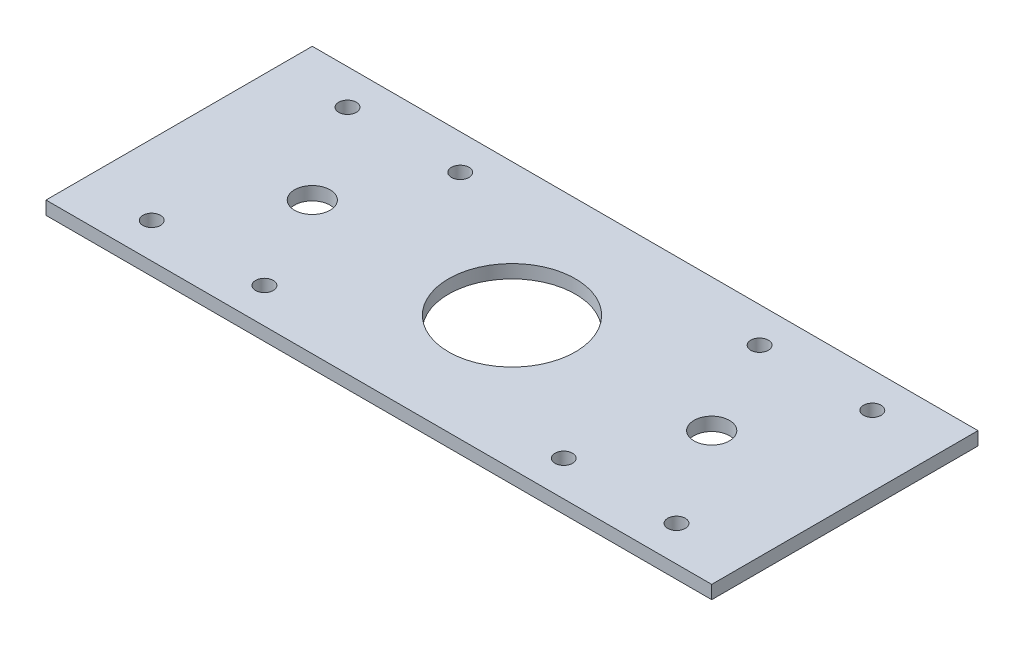
ISO-10303-21;
HEADER;
FILE_DESCRIPTION(('STEP AP214'),'2;1');
FILE_NAME('part.step','',(''),(''),'','','');
FILE_SCHEMA(('AUTOMOTIVE_DESIGN { 1 0 10303 214 1 1 1 1 }'));
ENDSEC;
DATA;
#1=APPLICATION_CONTEXT('core data for automotive mechanical design processes');
#2=APPLICATION_PROTOCOL_DEFINITION('international standard','automotive_design',2000,#1);
#3=PRODUCT_CONTEXT('',#1,'mechanical');
#4=PRODUCT('Part','Part','',(#3));
#5=PRODUCT_RELATED_PRODUCT_CATEGORY('part','',(#4));
#6=PRODUCT_DEFINITION_FORMATION('','',#4);
#7=PRODUCT_DEFINITION_CONTEXT('part definition',#1,'design');
#8=PRODUCT_DEFINITION('design','',#6,#7);
#9=PRODUCT_DEFINITION_SHAPE('','',#8);
#10=(LENGTH_UNIT() NAMED_UNIT(*) SI_UNIT(.MILLI.,.METRE.));
#11=(NAMED_UNIT(*) PLANE_ANGLE_UNIT() SI_UNIT($,.RADIAN.));
#12=(NAMED_UNIT(*) SI_UNIT($,.STERADIAN.) SOLID_ANGLE_UNIT());
#13=UNCERTAINTY_MEASURE_WITH_UNIT(LENGTH_MEASURE(1.E-05),#10,'distance_accuracy_value','');
#14=(GEOMETRIC_REPRESENTATION_CONTEXT(3) GLOBAL_UNCERTAINTY_ASSIGNED_CONTEXT((#13)) GLOBAL_UNIT_ASSIGNED_CONTEXT((#10,
#11,#12)) REPRESENTATION_CONTEXT('',''));
#15=CARTESIAN_POINT('',(0.,0.,0.));
#16=DIRECTION('',(0.,0.,1.));
#17=DIRECTION('',(1.,0.,0.));
#18=AXIS2_PLACEMENT_3D('',#15,#16,#17);
#19=CARTESIAN_POINT('',(0.,3.,30.));
#20=DIRECTION('',(0.,0.,-1.));
#21=DIRECTION('',(-1.,0.,0.));
#22=AXIS2_PLACEMENT_3D('',#19,#20,#21);
#23=PLANE('',#22);
#24=DIRECTION('',(1.,0.,0.));
#25=VECTOR('',#24,1.);
#26=CARTESIAN_POINT('',(0.,0.,30.));
#27=LINE('',#26,#25);
#28=CARTESIAN_POINT('',(-75.,0.,30.));
#29=VERTEX_POINT('',#28);
#30=CARTESIAN_POINT('',(75.,0.,30.));
#31=VERTEX_POINT('',#30);
#32=EDGE_CURVE('E98',#29,#31,#27,.T.);
#33=ORIENTED_EDGE('',*,*,#32,.T.);
#34=DIRECTION('',(0.,-1.,0.));
#35=VECTOR('',#34,1.);
#36=CARTESIAN_POINT('',(75.,3.,30.));
#37=LINE('',#36,#35);
#38=CARTESIAN_POINT('',(75.,3.,30.));
#39=VERTEX_POINT('',#38);
#40=EDGE_CURVE('E11',#39,#31,#37,.T.);
#41=ORIENTED_EDGE('',*,*,#40,.F.);
#42=DIRECTION('',(1.,0.,0.));
#43=VECTOR('',#42,1.);
#44=CARTESIAN_POINT('',(0.,3.,30.));
#45=LINE('',#44,#43);
#46=CARTESIAN_POINT('',(-75.,3.,30.));
#47=VERTEX_POINT('',#46);
#48=EDGE_CURVE('E84',#47,#39,#45,.T.);
#49=ORIENTED_EDGE('',*,*,#48,.F.);
#50=DIRECTION('',(0.,-1.,0.));
#51=VECTOR('',#50,1.);
#52=CARTESIAN_POINT('',(-75.,3.,30.));
#53=LINE('',#52,#51);
#54=EDGE_CURVE('E51',#47,#29,#53,.T.);
#55=ORIENTED_EDGE('',*,*,#54,.T.);
#56=EDGE_LOOP('',(#33,#41,#49,#55));
#57=FACE_BOUND('',#56,.T.);
#58=ADVANCED_FACE('F35',(#57),#23,.F.);
#59=CARTESIAN_POINT('',(75.,3.,0.));
#60=DIRECTION('',(-1.,0.,0.));
#61=DIRECTION('',(0.,0.,1.));
#62=AXIS2_PLACEMENT_3D('',#59,#60,#61);
#63=PLANE('',#62);
#64=DIRECTION('',(0.,0.,-1.));
#65=VECTOR('',#64,1.);
#66=CARTESIAN_POINT('',(75.,0.,0.));
#67=LINE('',#66,#65);
#68=CARTESIAN_POINT('',(75.,0.,-30.));
#69=VERTEX_POINT('',#68);
#70=EDGE_CURVE('E89',#31,#69,#67,.T.);
#71=ORIENTED_EDGE('',*,*,#70,.T.);
#72=DIRECTION('',(0.,-1.,0.));
#73=VECTOR('',#72,1.);
#74=CARTESIAN_POINT('',(75.,3.,-30.));
#75=LINE('',#74,#73);
#76=CARTESIAN_POINT('',(75.,3.,-30.));
#77=VERTEX_POINT('',#76);
#78=EDGE_CURVE('E43',#77,#69,#75,.T.);
#79=ORIENTED_EDGE('',*,*,#78,.F.);
#80=DIRECTION('',(0.,0.,-1.));
#81=VECTOR('',#80,1.);
#82=CARTESIAN_POINT('',(75.,3.,0.));
#83=LINE('',#82,#81);
#84=EDGE_CURVE('E76',#39,#77,#83,.T.);
#85=ORIENTED_EDGE('',*,*,#84,.F.);
#86=ORIENTED_EDGE('',*,*,#40,.T.);
#87=EDGE_LOOP('',(#71,#79,#85,#86));
#88=FACE_BOUND('',#87,.T.);
#89=ADVANCED_FACE('F88',(#88),#63,.F.);
#90=CARTESIAN_POINT('',(0.,3.,-30.));
#91=DIRECTION('',(0.,0.,-1.));
#92=DIRECTION('',(-1.,0.,0.));
#93=AXIS2_PLACEMENT_3D('',#90,#91,#92);
#94=PLANE('',#93);
#95=DIRECTION('',(1.,0.,0.));
#96=VECTOR('',#95,1.);
#97=CARTESIAN_POINT('',(0.,0.,-30.));
#98=LINE('',#97,#96);
#99=CARTESIAN_POINT('',(-75.,0.,-30.));
#100=VERTEX_POINT('',#99);
#101=EDGE_CURVE('E102',#100,#69,#98,.T.);
#102=ORIENTED_EDGE('',*,*,#101,.F.);
#103=DIRECTION('',(0.,-1.,0.));
#104=VECTOR('',#103,1.);
#105=CARTESIAN_POINT('',(-75.,3.,-30.));
#106=LINE('',#105,#104);
#107=CARTESIAN_POINT('',(-75.,3.,-30.));
#108=VERTEX_POINT('',#107);
#109=EDGE_CURVE('E65',#108,#100,#106,.T.);
#110=ORIENTED_EDGE('',*,*,#109,.F.);
#111=DIRECTION('',(1.,0.,0.));
#112=VECTOR('',#111,1.);
#113=CARTESIAN_POINT('',(0.,3.,-30.));
#114=LINE('',#113,#112);
#115=EDGE_CURVE('E83',#108,#77,#114,.T.);
#116=ORIENTED_EDGE('',*,*,#115,.T.);
#117=ORIENTED_EDGE('',*,*,#78,.T.);
#118=EDGE_LOOP('',(#102,#110,#116,#117));
#119=FACE_BOUND('',#118,.T.);
#120=ADVANCED_FACE('F92',(#119),#94,.T.);
#121=CARTESIAN_POINT('',(-75.,3.,0.));
#122=DIRECTION('',(-1.,0.,0.));
#123=DIRECTION('',(0.,0.,1.));
#124=AXIS2_PLACEMENT_3D('',#121,#122,#123);
#125=PLANE('',#124);
#126=DIRECTION('',(0.,0.,-1.));
#127=VECTOR('',#126,1.);
#128=CARTESIAN_POINT('',(-75.,0.,0.));
#129=LINE('',#128,#127);
#130=EDGE_CURVE('E104',#29,#100,#129,.T.);
#131=ORIENTED_EDGE('',*,*,#130,.F.);
#132=ORIENTED_EDGE('',*,*,#54,.F.);
#133=DIRECTION('',(0.,0.,-1.));
#134=VECTOR('',#133,1.);
#135=CARTESIAN_POINT('',(-75.,3.,0.));
#136=LINE('',#135,#134);
#137=EDGE_CURVE('E93',#47,#108,#136,.T.);
#138=ORIENTED_EDGE('',*,*,#137,.T.);
#139=ORIENTED_EDGE('',*,*,#109,.T.);
#140=EDGE_LOOP('',(#131,#132,#138,#139));
#141=FACE_BOUND('',#140,.T.);
#142=ADVANCED_FACE('F188',(#141),#125,.T.);
#143=CARTESIAN_POINT('',(0.,3.,0.));
#144=DIRECTION('',(0.,1.,0.));
#145=DIRECTION('',(0.,0.,1.));
#146=AXIS2_PLACEMENT_3D('',#143,#144,#145);
#147=PLANE('',#146);
#148=CARTESIAN_POINT('',(-45.,3.,0.));
#149=DIRECTION('',(0.,1.,0.));
#150=DIRECTION('',(0.,0.,-1.));
#151=AXIS2_PLACEMENT_3D('',#148,#149,#150);
#152=CIRCLE('',#151,4.00000000000002);
#153=CARTESIAN_POINT('',(-45.,3.,-4.00000000000001));
#154=VERTEX_POINT('',#153);
#155=EDGE_CURVE('E170',#154,#154,#152,.T.);
#156=ORIENTED_EDGE('',*,*,#155,.F.);
#157=EDGE_LOOP('',(#156));
#158=FACE_BOUND('',#157,.T.);
#159=CARTESIAN_POINT('',(45.,3.,0.));
#160=DIRECTION('',(0.,1.,0.));
#161=DIRECTION('',(0.,0.,1.));
#162=AXIS2_PLACEMENT_3D('',#159,#160,#161);
#163=CIRCLE('',#162,4.00000000000001);
#164=CARTESIAN_POINT('',(45.,3.,4.00000000000001));
#165=VERTEX_POINT('',#164);
#166=EDGE_CURVE('E164',#165,#165,#163,.T.);
#167=ORIENTED_EDGE('',*,*,#166,.F.);
#168=EDGE_LOOP('',(#167));
#169=FACE_BOUND('',#168,.T.);
#170=CARTESIAN_POINT('',(-33.725,3.,22.0625));
#171=DIRECTION('',(0.,1.,0.));
#172=DIRECTION('',(0.,0.,1.));
#173=AXIS2_PLACEMENT_3D('',#170,#171,#172);
#174=CIRCLE('',#173,1.98437499999999);
#175=CARTESIAN_POINT('',(-33.725,3.,24.046875));
#176=VERTEX_POINT('',#175);
#177=EDGE_CURVE('E158',#176,#176,#174,.T.);
#178=ORIENTED_EDGE('',*,*,#177,.F.);
#179=EDGE_LOOP('',(#178));
#180=FACE_BOUND('',#179,.T.);
#181=CARTESIAN_POINT('',(-59.125,3.,22.0625));
#182=DIRECTION('',(0.,1.,0.));
#183=DIRECTION('',(0.,0.,1.));
#184=AXIS2_PLACEMENT_3D('',#181,#182,#183);
#185=CIRCLE('',#184,1.98437499999999);
#186=CARTESIAN_POINT('',(-59.125,3.,24.046875));
#187=VERTEX_POINT('',#186);
#188=EDGE_CURVE('E152',#187,#187,#185,.T.);
#189=ORIENTED_EDGE('',*,*,#188,.F.);
#190=EDGE_LOOP('',(#189));
#191=FACE_BOUND('',#190,.T.);
#192=CARTESIAN_POINT('',(-59.125,3.,-22.0625));
#193=DIRECTION('',(0.,1.,0.));
#194=DIRECTION('',(0.,0.,-1.));
#195=AXIS2_PLACEMENT_3D('',#192,#193,#194);
#196=CIRCLE('',#195,1.98437499999999);
#197=CARTESIAN_POINT('',(-59.125,3.,-24.046875));
#198=VERTEX_POINT('',#197);
#199=EDGE_CURVE('E146',#198,#198,#196,.T.);
#200=ORIENTED_EDGE('',*,*,#199,.F.);
#201=EDGE_LOOP('',(#200));
#202=FACE_BOUND('',#201,.T.);
#203=CARTESIAN_POINT('',(-33.725,3.,-22.0625));
#204=DIRECTION('',(0.,1.,0.));
#205=DIRECTION('',(0.,0.,-1.));
#206=AXIS2_PLACEMENT_3D('',#203,#204,#205);
#207=CIRCLE('',#206,1.98437499999999);
#208=CARTESIAN_POINT('',(-33.725,3.,-24.046875));
#209=VERTEX_POINT('',#208);
#210=EDGE_CURVE('E140',#209,#209,#207,.T.);
#211=ORIENTED_EDGE('',*,*,#210,.F.);
#212=EDGE_LOOP('',(#211));
#213=FACE_BOUND('',#212,.T.);
#214=CARTESIAN_POINT('',(59.125,3.,22.0625));
#215=DIRECTION('',(0.,1.,0.));
#216=DIRECTION('',(0.,0.,-1.));
#217=AXIS2_PLACEMENT_3D('',#214,#215,#216);
#218=CIRCLE('',#217,1.98437499999999);
#219=CARTESIAN_POINT('',(59.125,3.,20.078125));
#220=VERTEX_POINT('',#219);
#221=EDGE_CURVE('E134',#220,#220,#218,.T.);
#222=ORIENTED_EDGE('',*,*,#221,.F.);
#223=EDGE_LOOP('',(#222));
#224=FACE_BOUND('',#223,.T.);
#225=CARTESIAN_POINT('',(33.725,3.,22.0625));
#226=DIRECTION('',(0.,1.,0.));
#227=DIRECTION('',(0.,0.,-1.));
#228=AXIS2_PLACEMENT_3D('',#225,#226,#227);
#229=CIRCLE('',#228,1.98437499999999);
#230=CARTESIAN_POINT('',(33.725,3.,20.078125));
#231=VERTEX_POINT('',#230);
#232=EDGE_CURVE('E128',#231,#231,#229,.T.);
#233=ORIENTED_EDGE('',*,*,#232,.F.);
#234=EDGE_LOOP('',(#233));
#235=FACE_BOUND('',#234,.T.);
#236=CARTESIAN_POINT('',(33.725,3.,-22.0625));
#237=DIRECTION('',(0.,1.,0.));
#238=DIRECTION('',(0.,0.,1.));
#239=AXIS2_PLACEMENT_3D('',#236,#237,#238);
#240=CIRCLE('',#239,1.98437499999999);
#241=CARTESIAN_POINT('',(33.725,3.,-20.078125));
#242=VERTEX_POINT('',#241);
#243=EDGE_CURVE('E122',#242,#242,#240,.T.);
#244=ORIENTED_EDGE('',*,*,#243,.F.);
#245=EDGE_LOOP('',(#244));
#246=FACE_BOUND('',#245,.T.);
#247=CARTESIAN_POINT('',(59.125,3.,-22.0625));
#248=DIRECTION('',(0.,1.,0.));
#249=DIRECTION('',(0.,0.,1.));
#250=AXIS2_PLACEMENT_3D('',#247,#248,#249);
#251=CIRCLE('',#250,1.98437499999999);
#252=CARTESIAN_POINT('',(59.125,3.,-20.078125));
#253=VERTEX_POINT('',#252);
#254=EDGE_CURVE('E116',#253,#253,#251,.T.);
#255=ORIENTED_EDGE('',*,*,#254,.F.);
#256=EDGE_LOOP('',(#255));
#257=FACE_BOUND('',#256,.T.);
#258=CARTESIAN_POINT('',(0.,3.,0.));
#259=DIRECTION('',(0.,1.,0.));
#260=DIRECTION('',(0.,0.,1.));
#261=AXIS2_PLACEMENT_3D('',#258,#259,#260);
#262=CIRCLE('',#261,14.2875);
#263=CARTESIAN_POINT('',(0.,3.,14.2875));
#264=VERTEX_POINT('',#263);
#265=EDGE_CURVE('E110',#264,#264,#262,.T.);
#266=ORIENTED_EDGE('',*,*,#265,.F.);
#267=EDGE_LOOP('',(#266));
#268=FACE_BOUND('',#267,.T.);
#269=ORIENTED_EDGE('',*,*,#48,.T.);
#270=ORIENTED_EDGE('',*,*,#84,.T.);
#271=ORIENTED_EDGE('',*,*,#115,.F.);
#272=ORIENTED_EDGE('',*,*,#137,.F.);
#273=EDGE_LOOP('',(#269,#270,#271,#272));
#274=FACE_BOUND('',#273,.T.);
#275=ADVANCED_FACE('F80',(#158,#169,#180,#191,#202,#213,#224,#235,#246,#257,#268,#274),#147,.T.);
#276=CARTESIAN_POINT('',(0.,0.,0.));
#277=DIRECTION('',(0.,1.,0.));
#278=DIRECTION('',(0.,0.,1.));
#279=AXIS2_PLACEMENT_3D('',#276,#277,#278);
#280=PLANE('',#279);
#281=CARTESIAN_POINT('',(-45.,0.,0.));
#282=DIRECTION('',(0.,1.,0.));
#283=DIRECTION('',(0.,0.,-1.));
#284=AXIS2_PLACEMENT_3D('',#281,#282,#283);
#285=CIRCLE('',#284,4.00000000000002);
#286=CARTESIAN_POINT('',(-45.,0.,-4.00000000000001));
#287=VERTEX_POINT('',#286);
#288=EDGE_CURVE('E167',#287,#287,#285,.T.);
#289=ORIENTED_EDGE('',*,*,#288,.T.);
#290=EDGE_LOOP('',(#289));
#291=FACE_BOUND('',#290,.T.);
#292=CARTESIAN_POINT('',(45.,0.,0.));
#293=DIRECTION('',(0.,1.,0.));
#294=DIRECTION('',(0.,0.,1.));
#295=AXIS2_PLACEMENT_3D('',#292,#293,#294);
#296=CIRCLE('',#295,4.00000000000001);
#297=CARTESIAN_POINT('',(45.,0.,4.00000000000001));
#298=VERTEX_POINT('',#297);
#299=EDGE_CURVE('E161',#298,#298,#296,.T.);
#300=ORIENTED_EDGE('',*,*,#299,.T.);
#301=EDGE_LOOP('',(#300));
#302=FACE_BOUND('',#301,.T.);
#303=CARTESIAN_POINT('',(-33.725,0.,22.0625));
#304=DIRECTION('',(0.,1.,0.));
#305=DIRECTION('',(0.,0.,1.));
#306=AXIS2_PLACEMENT_3D('',#303,#304,#305);
#307=CIRCLE('',#306,1.98437499999999);
#308=CARTESIAN_POINT('',(-33.725,0.,24.046875));
#309=VERTEX_POINT('',#308);
#310=EDGE_CURVE('E155',#309,#309,#307,.T.);
#311=ORIENTED_EDGE('',*,*,#310,.T.);
#312=EDGE_LOOP('',(#311));
#313=FACE_BOUND('',#312,.T.);
#314=CARTESIAN_POINT('',(-59.125,0.,22.0625));
#315=DIRECTION('',(0.,1.,0.));
#316=DIRECTION('',(0.,0.,1.));
#317=AXIS2_PLACEMENT_3D('',#314,#315,#316);
#318=CIRCLE('',#317,1.98437499999999);
#319=CARTESIAN_POINT('',(-59.125,0.,24.046875));
#320=VERTEX_POINT('',#319);
#321=EDGE_CURVE('E149',#320,#320,#318,.T.);
#322=ORIENTED_EDGE('',*,*,#321,.T.);
#323=EDGE_LOOP('',(#322));
#324=FACE_BOUND('',#323,.T.);
#325=CARTESIAN_POINT('',(-59.125,0.,-22.0625));
#326=DIRECTION('',(0.,1.,0.));
#327=DIRECTION('',(0.,0.,-1.));
#328=AXIS2_PLACEMENT_3D('',#325,#326,#327);
#329=CIRCLE('',#328,1.98437499999999);
#330=CARTESIAN_POINT('',(-59.125,0.,-24.046875));
#331=VERTEX_POINT('',#330);
#332=EDGE_CURVE('E143',#331,#331,#329,.T.);
#333=ORIENTED_EDGE('',*,*,#332,.T.);
#334=EDGE_LOOP('',(#333));
#335=FACE_BOUND('',#334,.T.);
#336=CARTESIAN_POINT('',(-33.725,0.,-22.0625));
#337=DIRECTION('',(0.,1.,0.));
#338=DIRECTION('',(0.,0.,-1.));
#339=AXIS2_PLACEMENT_3D('',#336,#337,#338);
#340=CIRCLE('',#339,1.98437499999999);
#341=CARTESIAN_POINT('',(-33.725,0.,-24.046875));
#342=VERTEX_POINT('',#341);
#343=EDGE_CURVE('E137',#342,#342,#340,.T.);
#344=ORIENTED_EDGE('',*,*,#343,.T.);
#345=EDGE_LOOP('',(#344));
#346=FACE_BOUND('',#345,.T.);
#347=CARTESIAN_POINT('',(59.125,0.,22.0625));
#348=DIRECTION('',(0.,1.,0.));
#349=DIRECTION('',(0.,0.,-1.));
#350=AXIS2_PLACEMENT_3D('',#347,#348,#349);
#351=CIRCLE('',#350,1.98437499999999);
#352=CARTESIAN_POINT('',(59.125,0.,20.078125));
#353=VERTEX_POINT('',#352);
#354=EDGE_CURVE('E131',#353,#353,#351,.T.);
#355=ORIENTED_EDGE('',*,*,#354,.T.);
#356=EDGE_LOOP('',(#355));
#357=FACE_BOUND('',#356,.T.);
#358=CARTESIAN_POINT('',(33.725,0.,22.0625));
#359=DIRECTION('',(0.,1.,0.));
#360=DIRECTION('',(0.,0.,-1.));
#361=AXIS2_PLACEMENT_3D('',#358,#359,#360);
#362=CIRCLE('',#361,1.98437499999999);
#363=CARTESIAN_POINT('',(33.725,0.,20.078125));
#364=VERTEX_POINT('',#363);
#365=EDGE_CURVE('E125',#364,#364,#362,.T.);
#366=ORIENTED_EDGE('',*,*,#365,.T.);
#367=EDGE_LOOP('',(#366));
#368=FACE_BOUND('',#367,.T.);
#369=CARTESIAN_POINT('',(33.725,0.,-22.0625));
#370=DIRECTION('',(0.,1.,0.));
#371=DIRECTION('',(0.,0.,1.));
#372=AXIS2_PLACEMENT_3D('',#369,#370,#371);
#373=CIRCLE('',#372,1.98437499999999);
#374=CARTESIAN_POINT('',(33.725,0.,-20.078125));
#375=VERTEX_POINT('',#374);
#376=EDGE_CURVE('E119',#375,#375,#373,.T.);
#377=ORIENTED_EDGE('',*,*,#376,.T.);
#378=EDGE_LOOP('',(#377));
#379=FACE_BOUND('',#378,.T.);
#380=CARTESIAN_POINT('',(59.125,0.,-22.0625));
#381=DIRECTION('',(0.,1.,0.));
#382=DIRECTION('',(0.,0.,1.));
#383=AXIS2_PLACEMENT_3D('',#380,#381,#382);
#384=CIRCLE('',#383,1.98437499999999);
#385=CARTESIAN_POINT('',(59.125,0.,-20.078125));
#386=VERTEX_POINT('',#385);
#387=EDGE_CURVE('E113',#386,#386,#384,.T.);
#388=ORIENTED_EDGE('',*,*,#387,.T.);
#389=EDGE_LOOP('',(#388));
#390=FACE_BOUND('',#389,.T.);
#391=CARTESIAN_POINT('',(0.,0.,0.));
#392=DIRECTION('',(0.,1.,0.));
#393=DIRECTION('',(0.,0.,1.));
#394=AXIS2_PLACEMENT_3D('',#391,#392,#393);
#395=CIRCLE('',#394,14.2875);
#396=CARTESIAN_POINT('',(0.,0.,14.2875));
#397=VERTEX_POINT('',#396);
#398=EDGE_CURVE('E100',#397,#397,#395,.T.);
#399=ORIENTED_EDGE('',*,*,#398,.T.);
#400=EDGE_LOOP('',(#399));
#401=FACE_BOUND('',#400,.T.);
#402=ORIENTED_EDGE('',*,*,#32,.F.);
#403=ORIENTED_EDGE('',*,*,#130,.T.);
#404=ORIENTED_EDGE('',*,*,#101,.T.);
#405=ORIENTED_EDGE('',*,*,#70,.F.);
#406=EDGE_LOOP('',(#402,#403,#404,#405));
#407=FACE_BOUND('',#406,.T.);
#408=ADVANCED_FACE('F176',(#291,#302,#313,#324,#335,#346,#357,#368,#379,#390,#401,#407),#280,.F.);
#409=CARTESIAN_POINT('',(0.,0.,0.));
#410=DIRECTION('',(0.,1.,0.));
#411=DIRECTION('',(0.,0.,1.));
#412=AXIS2_PLACEMENT_3D('',#409,#410,#411);
#413=CYLINDRICAL_SURFACE('',#412,14.2875);
#414=ORIENTED_EDGE('',*,*,#398,.F.);
#415=EDGE_LOOP('',(#414));
#416=FACE_BOUND('',#415,.T.);
#417=ORIENTED_EDGE('',*,*,#265,.T.);
#418=EDGE_LOOP('',(#417));
#419=FACE_BOUND('',#418,.T.);
#420=ADVANCED_FACE('F210',(#416,#419),#413,.F.);
#421=CARTESIAN_POINT('',(59.125,0.,-22.0625));
#422=DIRECTION('',(0.,1.,0.));
#423=DIRECTION('',(0.,0.,1.));
#424=AXIS2_PLACEMENT_3D('',#421,#422,#423);
#425=CYLINDRICAL_SURFACE('',#424,1.98437499999999);
#426=ORIENTED_EDGE('',*,*,#387,.F.);
#427=EDGE_LOOP('',(#426));
#428=FACE_BOUND('',#427,.T.);
#429=ORIENTED_EDGE('',*,*,#254,.T.);
#430=EDGE_LOOP('',(#429));
#431=FACE_BOUND('',#430,.T.);
#432=ADVANCED_FACE('F212',(#428,#431),#425,.F.);
#433=CARTESIAN_POINT('',(33.725,0.,-22.0625));
#434=DIRECTION('',(0.,1.,0.));
#435=DIRECTION('',(0.,0.,1.));
#436=AXIS2_PLACEMENT_3D('',#433,#434,#435);
#437=CYLINDRICAL_SURFACE('',#436,1.98437499999999);
#438=ORIENTED_EDGE('',*,*,#376,.F.);
#439=EDGE_LOOP('',(#438));
#440=FACE_BOUND('',#439,.T.);
#441=ORIENTED_EDGE('',*,*,#243,.T.);
#442=EDGE_LOOP('',(#441));
#443=FACE_BOUND('',#442,.T.);
#444=ADVANCED_FACE('F219',(#440,#443),#437,.F.);
#445=CARTESIAN_POINT('',(33.725,0.,22.0625));
#446=DIRECTION('',(0.,1.,0.));
#447=DIRECTION('',(0.,0.,1.));
#448=AXIS2_PLACEMENT_3D('',#445,#446,#447);
#449=CYLINDRICAL_SURFACE('',#448,1.98437499999999);
#450=ORIENTED_EDGE('',*,*,#365,.F.);
#451=EDGE_LOOP('',(#450));
#452=FACE_BOUND('',#451,.T.);
#453=ORIENTED_EDGE('',*,*,#232,.T.);
#454=EDGE_LOOP('',(#453));
#455=FACE_BOUND('',#454,.T.);
#456=ADVANCED_FACE('F285',(#452,#455),#449,.F.);
#457=CARTESIAN_POINT('',(59.125,0.,22.0625));
#458=DIRECTION('',(0.,1.,0.));
#459=DIRECTION('',(0.,0.,1.));
#460=AXIS2_PLACEMENT_3D('',#457,#458,#459);
#461=CYLINDRICAL_SURFACE('',#460,1.98437499999999);
#462=ORIENTED_EDGE('',*,*,#354,.F.);
#463=EDGE_LOOP('',(#462));
#464=FACE_BOUND('',#463,.T.);
#465=ORIENTED_EDGE('',*,*,#221,.T.);
#466=EDGE_LOOP('',(#465));
#467=FACE_BOUND('',#466,.T.);
#468=ADVANCED_FACE('F294',(#464,#467),#461,.F.);
#469=CARTESIAN_POINT('',(-33.725,0.,-22.0625));
#470=DIRECTION('',(0.,1.,0.));
#471=DIRECTION('',(0.,0.,1.));
#472=AXIS2_PLACEMENT_3D('',#469,#470,#471);
#473=CYLINDRICAL_SURFACE('',#472,1.98437499999999);
#474=ORIENTED_EDGE('',*,*,#343,.F.);
#475=EDGE_LOOP('',(#474));
#476=FACE_BOUND('',#475,.T.);
#477=ORIENTED_EDGE('',*,*,#210,.T.);
#478=EDGE_LOOP('',(#477));
#479=FACE_BOUND('',#478,.T.);
#480=ADVANCED_FACE('F303',(#476,#479),#473,.F.);
#481=CARTESIAN_POINT('',(-59.125,0.,-22.0625));
#482=DIRECTION('',(0.,1.,0.));
#483=DIRECTION('',(0.,0.,1.));
#484=AXIS2_PLACEMENT_3D('',#481,#482,#483);
#485=CYLINDRICAL_SURFACE('',#484,1.98437499999999);
#486=ORIENTED_EDGE('',*,*,#332,.F.);
#487=EDGE_LOOP('',(#486));
#488=FACE_BOUND('',#487,.T.);
#489=ORIENTED_EDGE('',*,*,#199,.T.);
#490=EDGE_LOOP('',(#489));
#491=FACE_BOUND('',#490,.T.);
#492=ADVANCED_FACE('F312',(#488,#491),#485,.F.);
#493=CARTESIAN_POINT('',(-59.125,0.,22.0625));
#494=DIRECTION('',(0.,1.,0.));
#495=DIRECTION('',(0.,0.,1.));
#496=AXIS2_PLACEMENT_3D('',#493,#494,#495);
#497=CYLINDRICAL_SURFACE('',#496,1.98437499999999);
#498=ORIENTED_EDGE('',*,*,#321,.F.);
#499=EDGE_LOOP('',(#498));
#500=FACE_BOUND('',#499,.T.);
#501=ORIENTED_EDGE('',*,*,#188,.T.);
#502=EDGE_LOOP('',(#501));
#503=FACE_BOUND('',#502,.T.);
#504=ADVANCED_FACE('F321',(#500,#503),#497,.F.);
#505=CARTESIAN_POINT('',(-33.725,0.,22.0625));
#506=DIRECTION('',(0.,1.,0.));
#507=DIRECTION('',(0.,0.,1.));
#508=AXIS2_PLACEMENT_3D('',#505,#506,#507);
#509=CYLINDRICAL_SURFACE('',#508,1.98437499999999);
#510=ORIENTED_EDGE('',*,*,#310,.F.);
#511=EDGE_LOOP('',(#510));
#512=FACE_BOUND('',#511,.T.);
#513=ORIENTED_EDGE('',*,*,#177,.T.);
#514=EDGE_LOOP('',(#513));
#515=FACE_BOUND('',#514,.T.);
#516=ADVANCED_FACE('F330',(#512,#515),#509,.F.);
#517=CARTESIAN_POINT('',(45.,0.,0.));
#518=DIRECTION('',(0.,1.,0.));
#519=DIRECTION('',(0.,0.,1.));
#520=AXIS2_PLACEMENT_3D('',#517,#518,#519);
#521=CYLINDRICAL_SURFACE('',#520,4.00000000000001);
#522=ORIENTED_EDGE('',*,*,#299,.F.);
#523=EDGE_LOOP('',(#522));
#524=FACE_BOUND('',#523,.T.);
#525=ORIENTED_EDGE('',*,*,#166,.T.);
#526=EDGE_LOOP('',(#525));
#527=FACE_BOUND('',#526,.T.);
#528=ADVANCED_FACE('F182',(#524,#527),#521,.F.);
#529=CARTESIAN_POINT('',(-45.,0.,0.));
#530=DIRECTION('',(0.,1.,0.));
#531=DIRECTION('',(0.,0.,1.));
#532=AXIS2_PLACEMENT_3D('',#529,#530,#531);
#533=CYLINDRICAL_SURFACE('',#532,4.00000000000002);
#534=ORIENTED_EDGE('',*,*,#288,.F.);
#535=EDGE_LOOP('',(#534));
#536=FACE_BOUND('',#535,.T.);
#537=ORIENTED_EDGE('',*,*,#155,.T.);
#538=EDGE_LOOP('',(#537));
#539=FACE_BOUND('',#538,.T.);
#540=ADVANCED_FACE('F179',(#536,#539),#533,.F.);
#541=CLOSED_SHELL('',(#58,#89,#120,#142,#275,#408,#420,#432,#444,#456,#468,#480,#492,#504,#516,
#528,#540));
#542=MANIFOLD_SOLID_BREP('B2',#541);
#543=ADVANCED_BREP_SHAPE_REPRESENTATION('',(#18,#542),#14);
#544=SHAPE_DEFINITION_REPRESENTATION(#9,#543);
ENDSEC;
END-ISO-10303-21;
